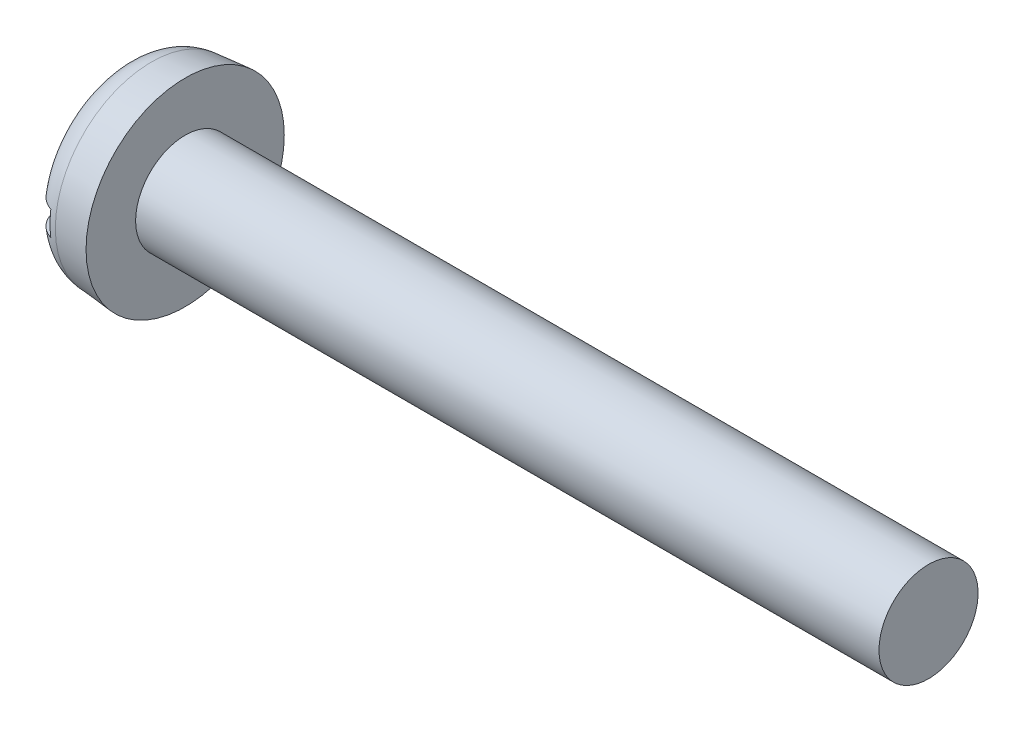
ISO-10303-21;
HEADER;
FILE_DESCRIPTION(('STEP AP214'),'2;1');
FILE_NAME('part.step','',(''),(''),'','','');
FILE_SCHEMA(('AUTOMOTIVE_DESIGN { 1 0 10303 214 1 1 1 1 }'));
ENDSEC;
DATA;
#1=APPLICATION_CONTEXT('core data for automotive mechanical design processes');
#2=APPLICATION_PROTOCOL_DEFINITION('international standard','automotive_design',2000,#1);
#3=PRODUCT_CONTEXT('',#1,'mechanical');
#4=PRODUCT('Part','Part','',(#3));
#5=PRODUCT_RELATED_PRODUCT_CATEGORY('part','',(#4));
#6=PRODUCT_DEFINITION_FORMATION('','',#4);
#7=PRODUCT_DEFINITION_CONTEXT('part definition',#1,'design');
#8=PRODUCT_DEFINITION('design','',#6,#7);
#9=PRODUCT_DEFINITION_SHAPE('','',#8);
#10=(LENGTH_UNIT() NAMED_UNIT(*) SI_UNIT(.MILLI.,.METRE.));
#11=(NAMED_UNIT(*) PLANE_ANGLE_UNIT() SI_UNIT($,.RADIAN.));
#12=(NAMED_UNIT(*) SI_UNIT($,.STERADIAN.) SOLID_ANGLE_UNIT());
#13=UNCERTAINTY_MEASURE_WITH_UNIT(LENGTH_MEASURE(1.E-05),#10,'distance_accuracy_value','');
#14=(GEOMETRIC_REPRESENTATION_CONTEXT(3) GLOBAL_UNCERTAINTY_ASSIGNED_CONTEXT((#13)) GLOBAL_UNIT_ASSIGNED_CONTEXT((#10,
#11,#12)) REPRESENTATION_CONTEXT('',''));
#15=CARTESIAN_POINT('',(0.,0.,0.));
#16=DIRECTION('',(0.,0.,1.));
#17=DIRECTION('',(1.,0.,0.));
#18=AXIS2_PLACEMENT_3D('',#15,#16,#17);
#19=CARTESIAN_POINT('',(0.,0.,0.));
#20=DIRECTION('',(-1.,0.,0.));
#21=DIRECTION('',(0.,0.,1.));
#22=AXIS2_PLACEMENT_3D('',#19,#20,#21);
#23=PLANE('',#22);
#24=DIRECTION('',(0.,0.,-1.));
#25=VECTOR('',#24,1.);
#26=CARTESIAN_POINT('',(0.,0.2,1.6));
#27=LINE('',#26,#25);
#28=CARTESIAN_POINT('',(0.,0.2,1.03520285906468));
#29=VERTEX_POINT('',#28);
#30=CARTESIAN_POINT('',(0.,0.2,-1.03520285906468));
#31=VERTEX_POINT('',#30);
#32=EDGE_CURVE('E97',#29,#31,#27,.T.);
#33=ORIENTED_EDGE('',*,*,#32,.F.);
#34=CARTESIAN_POINT('',(0.,0.,0.));
#35=DIRECTION('',(-1.,0.,0.));
#36=DIRECTION('',(0.,0.,1.));
#37=AXIS2_PLACEMENT_3D('',#34,#35,#36);
#38=CIRCLE('',#37,1.05434574946536);
#39=EDGE_CURVE('E102',#29,#31,#38,.T.);
#40=ORIENTED_EDGE('',*,*,#39,.T.);
#41=EDGE_LOOP('',(#33,#40));
#42=FACE_BOUND('',#41,.T.);
#43=ADVANCED_FACE('F39',(#42),#23,.T.);
#44=CARTESIAN_POINT('',(-25.4,0.,0.));
#45=DIRECTION('',(-1.,0.,0.));
#46=DIRECTION('',(0.,0.,1.));
#47=AXIS2_PLACEMENT_3D('',#44,#45,#46);
#48=CYLINDRICAL_SURFACE('',#47,0.8);
#49=CARTESIAN_POINT('',(13.,0.,0.));
#50=DIRECTION('',(-1.,0.,0.));
#51=DIRECTION('',(0.,0.,1.));
#52=AXIS2_PLACEMENT_3D('',#49,#50,#51);
#53=CIRCLE('',#52,0.8);
#54=CARTESIAN_POINT('',(13.,0.,0.8));
#55=VERTEX_POINT('',#54);
#56=EDGE_CURVE('E103',#55,#55,#53,.T.);
#57=ORIENTED_EDGE('',*,*,#56,.T.);
#58=EDGE_LOOP('',(#57));
#59=FACE_BOUND('',#58,.T.);
#60=CARTESIAN_POINT('',(1.,0.,0.));
#61=DIRECTION('',(-1.,0.,0.));
#62=DIRECTION('',(0.,0.,1.));
#63=AXIS2_PLACEMENT_3D('',#60,#61,#62);
#64=CIRCLE('',#63,0.8);
#65=CARTESIAN_POINT('',(1.,0.,0.8));
#66=VERTEX_POINT('',#65);
#67=EDGE_CURVE('E138',#66,#66,#64,.T.);
#68=ORIENTED_EDGE('',*,*,#67,.F.);
#69=EDGE_LOOP('',(#68));
#70=FACE_BOUND('',#69,.T.);
#71=ADVANCED_FACE('F155',(#59,#70),#48,.T.);
#72=CARTESIAN_POINT('',(13.,0.8,0.));
#73=DIRECTION('',(1.,0.,0.));
#74=DIRECTION('',(0.,0.,-1.));
#75=AXIS2_PLACEMENT_3D('',#72,#73,#74);
#76=PLANE('',#75);
#77=ORIENTED_EDGE('',*,*,#56,.F.);
#78=EDGE_LOOP('',(#77));
#79=FACE_BOUND('',#78,.T.);
#80=ADVANCED_FACE('F157',(#79),#76,.T.);
#81=DIRECTION('',(0.,0.,1.));
#82=VECTOR('',#81,1.);
#83=CARTESIAN_POINT('',(0.,-0.2,-1.6));
#84=LINE('',#83,#82);
#85=CARTESIAN_POINT('',(0.,-0.2,-1.03520285906468));
#86=VERTEX_POINT('',#85);
#87=CARTESIAN_POINT('',(0.,-0.2,1.03520285906468));
#88=VERTEX_POINT('',#87);
#89=EDGE_CURVE('E85',#86,#88,#84,.T.);
#90=ORIENTED_EDGE('',*,*,#89,.F.);
#91=EDGE_CURVE('E96',#86,#88,#38,.T.);
#92=ORIENTED_EDGE('',*,*,#91,.T.);
#93=EDGE_LOOP('',(#90,#92));
#94=FACE_BOUND('',#93,.T.);
#95=ADVANCED_FACE('F95',(#94),#23,.T.);
#96=CARTESIAN_POINT('',(0.,0.,0.));
#97=DIRECTION('',(1.,0.,0.));
#98=DIRECTION('',(0.,0.,-1.));
#99=AXIS2_PLACEMENT_3D('',#96,#97,#98);
#100=CONICAL_SURFACE('',#99,1.51251133647408,0.0872664625997166);
#101=CARTESIAN_POINT('',(0.45642212862617,0.,0.));
#102=DIRECTION('',(-1.,0.,0.));
#103=DIRECTION('',(0.,0.,1.));
#104=AXIS2_PLACEMENT_3D('',#101,#102,#103);
#105=CIRCLE('',#104,1.55244309851124);
#106=CARTESIAN_POINT('',(0.45642212862617,0.,1.55244309851124));
#107=VERTEX_POINT('',#106);
#108=EDGE_CURVE('E106',#107,#107,#105,.F.);
#109=ORIENTED_EDGE('',*,*,#108,.T.);
#110=EDGE_LOOP('',(#109));
#111=FACE_BOUND('',#110,.T.);
#112=CARTESIAN_POINT('',(1.,0.,0.));
#113=DIRECTION('',(-1.,0.,0.));
#114=DIRECTION('',(0.,0.,1.));
#115=AXIS2_PLACEMENT_3D('',#112,#113,#114);
#116=CIRCLE('',#115,1.6);
#117=CARTESIAN_POINT('',(1.,0.,1.6));
#118=VERTEX_POINT('',#117);
#119=EDGE_CURVE('E108',#118,#118,#116,.T.);
#120=ORIENTED_EDGE('',*,*,#119,.T.);
#121=EDGE_LOOP('',(#120));
#122=FACE_BOUND('',#121,.T.);
#123=ADVANCED_FACE('F148',(#111,#122),#100,.T.);
#124=CARTESIAN_POINT('',(1.,0.8,0.));
#125=DIRECTION('',(-1.,0.,0.));
#126=DIRECTION('',(0.,0.,1.));
#127=AXIS2_PLACEMENT_3D('',#124,#125,#126);
#128=PLANE('',#127);
#129=ORIENTED_EDGE('',*,*,#119,.F.);
#130=EDGE_LOOP('',(#129));
#131=FACE_BOUND('',#130,.T.);
#132=ORIENTED_EDGE('',*,*,#67,.T.);
#133=EDGE_LOOP('',(#132));
#134=FACE_BOUND('',#133,.T.);
#135=ADVANCED_FACE('F150',(#131,#134),#128,.F.);
#136=CARTESIAN_POINT('',(0.5,0.,0.));
#137=DIRECTION('',(-1.,0.,0.));
#138=DIRECTION('',(0.,0.,1.));
#139=AXIS2_PLACEMENT_3D('',#136,#137,#138);
#140=TOROIDAL_SURFACE('',#139,1.05434574946536,0.5);
#141=CARTESIAN_POINT('',(0.176812245338106,0.2,0.64242377529045));
#142=CARTESIAN_POINT('',(0.197656391566617,0.2,0.623931058161203));
#143=CARTESIAN_POINT('',(0.220003811754386,0.2,0.607110597550147));
#144=CARTESIAN_POINT('',(0.267180100797293,0.2,0.577365047702583));
#145=CARTESIAN_POINT('',(0.29201073445633,0.2,0.564442755444137));
#146=CARTESIAN_POINT('',(0.343577899023083,0.2,0.542985147318866));
#147=CARTESIAN_POINT('',(0.370318610468388,0.2,0.534459812106717));
#148=CARTESIAN_POINT('',(0.424877232699482,0.2,0.522255893957639));
#149=CARTESIAN_POINT('',(0.452694536220811,0.2,0.518574618533701));
#150=CARTESIAN_POINT('',(0.507347436456692,0.2,0.516300652750349));
#151=CARTESIAN_POINT('',(0.534174457413181,0.2,0.517498162918848));
#152=CARTESIAN_POINT('',(0.58723030288645,0.2,0.524448740072291));
#153=CARTESIAN_POINT('',(0.613459093306603,0.2,0.530202066055384));
#154=CARTESIAN_POINT('',(0.664260657505057,0.2,0.545888682290312));
#155=CARTESIAN_POINT('',(0.688850242352039,0.2,0.555767914890473));
#156=CARTESIAN_POINT('',(0.736143593168965,0.2,0.579309540129041));
#157=CARTESIAN_POINT('',(0.758846941478746,0.2,0.592972767752087));
#158=CARTESIAN_POINT('',(0.803002149253038,0.2,0.624449004423589));
#159=CARTESIAN_POINT('',(0.824325241599832,0.2,0.642442581537573));
#160=CARTESIAN_POINT('',(0.863838792989557,0.2,0.681591476361993));
#161=CARTESIAN_POINT('',(0.882028505825668,0.2,0.702747544977853));
#162=CARTESIAN_POINT('',(0.915707701545327,0.2,0.74883168283776));
#163=CARTESIAN_POINT('',(0.931007353951227,0.2,0.773898769970746));
#164=CARTESIAN_POINT('',(0.957255163391441,0.2,0.826217807423045));
#165=CARTESIAN_POINT('',(0.968202858285345,0.2,0.853469989411554));
#166=CARTESIAN_POINT('',(0.985551351159771,0.2,0.909833347099569));
#167=CARTESIAN_POINT('',(0.991882119167743,0.2,0.938966139449398));
#168=CARTESIAN_POINT('',(0.999504543382141,0.2,0.997884971759474));
#169=CARTESIAN_POINT('',(1.00079638965494,0.2,1.02767098703776));
#170=CARTESIAN_POINT('',(0.998270807715911,0.2,1.0867005797359));
#171=CARTESIAN_POINT('',(0.994509106386988,0.2,1.11594652682857));
#172=CARTESIAN_POINT('',(0.98203838488836,0.2,1.1733647846461));
#173=CARTESIAN_POINT('',(0.973329806868564,0.2,1.2015371910835));
#174=CARTESIAN_POINT('',(0.951381229972232,0.2,1.25547754006911));
#175=CARTESIAN_POINT('',(0.938224017100543,0.2,1.28127917230232));
#176=CARTESIAN_POINT('',(0.907700193056589,0.2,1.33025976678729));
#177=CARTESIAN_POINT('',(0.890333940077136,0.2,1.3534389519654));
#178=CARTESIAN_POINT('',(0.85217525831849,0.2,1.39614558195128));
#179=CARTESIAN_POINT('',(0.831439066113531,0.2,1.4157232869619));
#180=CARTESIAN_POINT('',(0.786943706790343,0.2,1.45107407519974));
#181=CARTESIAN_POINT('',(0.763184726605645,0.2,1.46684739352114));
#182=CARTESIAN_POINT('',(0.713591926333196,0.2,1.49397124782911));
#183=CARTESIAN_POINT('',(0.687782778867004,0.2,1.5053669084919));
#184=CARTESIAN_POINT('',(0.63461007787033,0.2,1.52363335073435));
#185=CARTESIAN_POINT('',(0.607246584142757,0.2,1.53050430627248));
#186=CARTESIAN_POINT('',(0.551920857622793,0.2,1.53948979359232));
#187=CARTESIAN_POINT('',(0.523963277706674,0.2,1.54163299551716));
#188=CARTESIAN_POINT('',(0.468086326713314,0.2,1.54118492593322));
#189=CARTESIAN_POINT('',(0.440166954979164,0.2,1.53859373687223));
#190=CARTESIAN_POINT('',(0.385217043681331,0.2,1.52876323513846));
#191=CARTESIAN_POINT('',(0.35818483875328,0.2,1.5215332253464));
#192=CARTESIAN_POINT('',(0.305714751463575,0.2,1.50264566880826));
#193=CARTESIAN_POINT('',(0.280276869405813,0.2,1.49098812121825));
#194=CARTESIAN_POINT('',(0.231662744368,0.2,1.4635592872359));
#195=CARTESIAN_POINT('',(0.208490831702472,0.2,1.44778032802949));
#196=CARTESIAN_POINT('',(0.165105790935981,0.2,1.4125771312255));
#197=CARTESIAN_POINT('',(0.144892723015596,0.2,1.39315281950264));
#198=CARTESIAN_POINT('',(0.107866474694936,0.2,1.35109338309971));
#199=CARTESIAN_POINT('',(0.0910739608161848,0.2,1.32844006983289));
#200=CARTESIAN_POINT('',(0.0614863187518137,0.2,1.28065921570801));
#201=CARTESIAN_POINT('',(0.0486913644535786,0.2,1.25553156728288));
#202=CARTESIAN_POINT('',(0.0273148341415875,0.2,1.20324342811195));
#203=CARTESIAN_POINT('',(0.0187777691661442,0.2,1.17606474761039));
#204=CARTESIAN_POINT('',(0.00631625826477566,0.2,1.12067195571522));
#205=CARTESIAN_POINT('',(0.00239193428353282,0.2,1.09245781696807));
#206=CARTESIAN_POINT('',(-0.000800718171925735,0.2,1.0353548754087));
#207=CARTESIAN_POINT('',(-2.54167093825939E-07,0.2,1.00646223595315));
#208=CARTESIAN_POINT('',(0.00635345942686706,0.2,0.949197931620799));
#209=CARTESIAN_POINT('',(0.0119082056813895,0.2,0.920826433674443));
#210=CARTESIAN_POINT('',(0.0277231669345134,0.2,0.864879673195364));
#211=CARTESIAN_POINT('',(0.038065816072315,0.2,0.837327748177695));
#212=CARTESIAN_POINT('',(0.0631658487432299,0.2,0.784336207465033));
#213=CARTESIAN_POINT('',(0.0779192415941294,0.2,0.758894708801055));
#214=CARTESIAN_POINT('',(0.106480616423255,0.2,0.717908727904648));
#215=CARTESIAN_POINT('',(0.119286907445074,0.2,0.701656482649832));
#216=CARTESIAN_POINT('',(0.14672396732377,0.2,0.67077086176156));
#217=CARTESIAN_POINT('',(0.161354756464739,0.2,0.656137504129709));
#218=CARTESIAN_POINT('',(0.176812245338106,0.2,0.64242377529045));
#219=B_SPLINE_CURVE_WITH_KNOTS('',3,(#141,#142,#143,#144,#145,#146,#147,#148,#149,#150,#151,
#152,#153,#154,#155,#156,#157,#158,#159,#160,#161,#162,#163,#164,#165,#166,#167,#168,#169,#170,
#171,#172,#173,#174,#175,#176,#177,#178,#179,#180,#181,#182,#183,#184,#185,#186,#187,#188,#189,
#190,#191,#192,#193,#194,#195,#196,#197,#198,#199,#200,#201,#202,#203,#204,#205,#206,#207,#208,
#209,#210,#211,#212,#213,#214,#215,#216,#217,#218),.UNSPECIFIED.,.T.,.F.,(4,2,2,2,2,2,2,2,2,2,2,
2,2,2,2,2,2,2,2,2,2,2,2,2,2,2,2,2,2,2,2,2,2,2,2,2,2,2,4),(0.,0.0835254361813604,
0.16711066099808,0.250884790042371,0.334612334986441,0.414778234839672,0.494948692451877,
0.574100167055879,0.65326912133305,0.736605061008668,0.819960819583614,0.907655316034342,
0.995359122399358,1.08436702847711,1.17337157717508,1.26140266077387,1.3494258774265,
1.43589378334721,1.52235433335935,1.60749748228452,1.69263536839262,1.77687047067773,
1.86110233424006,1.94482197647998,2.02854016078533,2.11209097577706,2.19564180669433,
2.2793493064507,2.36305850851542,2.44725937592745,2.53146390543144,2.61653114832757,
2.70160064005245,2.78791176181946,2.87425006464032,2.96213355572929,3.04993777240123,
3.11187742352654,3.17381776333526),.UNSPECIFIED.);
#220=CARTESIAN_POINT('',(0.35,0.2,1.51819850536022));
#221=VERTEX_POINT('',#220);
#222=EDGE_CURVE('E11',#221,#29,#219,.T.);
#223=ORIENTED_EDGE('',*,*,#222,.F.);
#224=CARTESIAN_POINT('',(0.35,0.,0.));
#225=DIRECTION('',(1.,0.,0.));
#226=DIRECTION('',(0.,0.,-1.));
#227=AXIS2_PLACEMENT_3D('',#224,#225,#226);
#228=CIRCLE('',#227,1.53131535017384);
#229=CARTESIAN_POINT('',(0.35,-0.2,1.51819850536022));
#230=VERTEX_POINT('',#229);
#231=EDGE_CURVE('E114',#230,#221,#228,.F.);
#232=ORIENTED_EDGE('',*,*,#231,.F.);
#233=CARTESIAN_POINT('',(0.176812245338106,-0.2,0.64242377529045));
#234=CARTESIAN_POINT('',(0.154702612307565,-0.2,0.662041585192781));
#235=CARTESIAN_POINT('',(0.134253297161549,-0.2,0.683570248770683));
#236=CARTESIAN_POINT('',(0.0972327579800641,-0.2,0.729775132087799));
#237=CARTESIAN_POINT('',(0.0806680483139015,-0.2,0.754456533338215));
#238=CARTESIAN_POINT('',(0.0519072561458669,-0.2,0.806221960091405));
#239=CARTESIAN_POINT('',(0.0397074393427576,-0.2,0.833303906979414));
#240=CARTESIAN_POINT('',(0.0200236232864323,-0.2,0.889118714678709));
#241=CARTESIAN_POINT('',(0.0125376920736543,-0.2,0.917850893876096));
#242=CARTESIAN_POINT('',(0.00251353684755929,-0.2,0.97621768314863));
#243=CARTESIAN_POINT('',(-1.64442575973229E-05,-0.2,1.00585371355918));
#244=CARTESIAN_POINT('',(1.66033602025546E-05,-0.2,1.06512652692138));
#245=CARTESIAN_POINT('',(0.00257970072502551,-0.2,1.09476330987778));
#246=CARTESIAN_POINT('',(0.0126917533382931,-0.2,1.1527074778913));
#247=CARTESIAN_POINT('',(0.0201638959754937,-0.2,1.18102825913155));
#248=CARTESIAN_POINT('',(0.0398408409860872,-0.2,1.2359754802176));
#249=CARTESIAN_POINT('',(0.0520451647411386,-0.2,1.26260209109683));
#250=CARTESIAN_POINT('',(0.0806073130285893,-0.2,1.31291602673095));
#251=CARTESIAN_POINT('',(0.0968895702503699,-0.2,1.33664625812301));
#252=CARTESIAN_POINT('',(0.133257839056495,-0.2,1.38098733360306));
#253=CARTESIAN_POINT('',(0.153343553406197,-0.2,1.40159842122129));
#254=CARTESIAN_POINT('',(0.196451203328787,-0.2,1.43882523867761));
#255=CARTESIAN_POINT('',(0.219429674182239,-0.2,1.45549131261205));
#256=CARTESIAN_POINT('',(0.267878667804026,-0.2,1.48468852159065));
#257=CARTESIAN_POINT('',(0.293349062314391,-0.2,1.49721986930193));
#258=CARTESIAN_POINT('',(0.345815128829973,-0.2,1.517681912311));
#259=CARTESIAN_POINT('',(0.372795327070427,-0.2,1.52565229791238));
#260=CARTESIAN_POINT('',(0.427713479707297,-0.2,1.53692751254217));
#261=CARTESIAN_POINT('',(0.455651404638834,-0.2,1.54023248497234));
#262=CARTESIAN_POINT('',(0.511557840216115,-0.2,1.54207504417347));
#263=CARTESIAN_POINT('',(0.539525649691558,-0.2,1.54063398012742));
#264=CARTESIAN_POINT('',(0.594821363561878,-0.2,1.53307394104472));
#265=CARTESIAN_POINT('',(0.622149274572845,-0.2,1.52695501439583));
#266=CARTESIAN_POINT('',(0.675376478271589,-0.2,1.51022327849377));
#267=CARTESIAN_POINT('',(0.701276516642561,-0.2,1.49961284047348));
#268=CARTESIAN_POINT('',(0.750935613149242,-0.2,1.47420824530533));
#269=CARTESIAN_POINT('',(0.774694654695417,-0.2,1.4594140557433));
#270=CARTESIAN_POINT('',(0.819487137689512,-0.2,1.42601464842765));
#271=CARTESIAN_POINT('',(0.840511160782153,-0.2,1.40739680279129));
#272=CARTESIAN_POINT('',(0.879162866353838,-0.2,1.36691918237975));
#273=CARTESIAN_POINT('',(0.8967904573245,-0.2,1.3450593202846));
#274=CARTESIAN_POINT('',(0.928296276700787,-0.2,1.29854787388723));
#275=CARTESIAN_POINT('',(0.942145481911513,-0.2,1.27387663567349));
#276=CARTESIAN_POINT('',(0.96556015148179,-0.2,1.22258005393831));
#277=CARTESIAN_POINT('',(0.975125409575014,-0.2,1.19595461639661));
#278=CARTESIAN_POINT('',(0.989830044230755,-0.2,1.14116777091253));
#279=CARTESIAN_POINT('',(0.994915183325904,-0.2,1.11299181373592));
#280=CARTESIAN_POINT('',(1.00036331847097,-0.2,1.05618799558154));
#281=CARTESIAN_POINT('',(1.00072594918917,-0.2,1.02756009981345));
#282=CARTESIAN_POINT('',(0.996728541355129,-0.2,0.970172137882063));
#283=CARTESIAN_POINT('',(0.992292215789273,-0.2,0.941417390803934));
#284=CARTESIAN_POINT('',(0.978738893833073,-0.2,0.885033177627237));
#285=CARTESIAN_POINT('',(0.969621429784218,-0.2,0.857403824256291));
#286=CARTESIAN_POINT('',(0.946786518376835,-0.2,0.803555744981816));
#287=CARTESIAN_POINT('',(0.932993027302192,-0.2,0.777369247398886));
#288=CARTESIAN_POINT('',(0.901235552715302,-0.2,0.727655106507426));
#289=CARTESIAN_POINT('',(0.883270945770642,-0.2,0.704127861444231));
#290=CARTESIAN_POINT('',(0.843510715272406,-0.2,0.660269585851966));
#291=CARTESIAN_POINT('',(0.821689860961845,-0.2,0.639961387802399));
#292=CARTESIAN_POINT('',(0.774870470566996,-0.2,0.603404198864377));
#293=CARTESIAN_POINT('',(0.749872173965661,-0.2,0.58715490233103));
#294=CARTESIAN_POINT('',(0.698057628210497,-0.2,0.559713743668722));
#295=CARTESIAN_POINT('',(0.671305060156738,-0.2,0.548402028597034));
#296=CARTESIAN_POINT('',(0.616208466179293,-0.2,0.530766704780977));
#297=CARTESIAN_POINT('',(0.587865482480594,-0.2,0.524439869329184));
#298=CARTESIAN_POINT('',(0.532256981834864,-0.2,0.517338275648884));
#299=CARTESIAN_POINT('',(0.505031591859405,-0.2,0.516247604966095));
#300=CARTESIAN_POINT('',(0.450800919779456,-0.2,0.518818406203716));
#301=CARTESIAN_POINT('',(0.423795667458096,-0.2,0.522480510746835));
#302=CARTESIAN_POINT('',(0.371631393142633,-0.2,0.534183158459801));
#303=CARTESIAN_POINT('',(0.346441169120205,-0.2,0.542086434018936));
#304=CARTESIAN_POINT('',(0.297683954206147,-0.2,0.561836906568103));
#305=CARTESIAN_POINT('',(0.274115374435305,-0.2,0.573680174801029));
#306=CARTESIAN_POINT('',(0.238350445927474,-0.2,0.595303011811934));
#307=CARTESIAN_POINT('',(0.225448951820625,-0.2,0.603942086476775));
#308=CARTESIAN_POINT('',(0.200483216576451,-0.2,0.622353186457711));
#309=CARTESIAN_POINT('',(0.188418951937856,-0.2,0.632125179951871));
#310=CARTESIAN_POINT('',(0.176812245338106,-0.2,0.64242377529045));
#311=B_SPLINE_CURVE_WITH_KNOTS('',3,(#233,#234,#235,#236,#237,#238,#239,#240,#241,#242,#243,
#244,#245,#246,#247,#248,#249,#250,#251,#252,#253,#254,#255,#256,#257,#258,#259,#260,#261,#262,
#263,#264,#265,#266,#267,#268,#269,#270,#271,#272,#273,#274,#275,#276,#277,#278,#279,#280,#281,
#282,#283,#284,#285,#286,#287,#288,#289,#290,#291,#292,#293,#294,#295,#296,#297,#298,#299,#300,
#301,#302,#303,#304,#305,#306,#307,#308,#309,#310),.UNSPECIFIED.,.T.,.F.,(4,2,2,2,2,2,2,2,2,2,2,
2,2,2,2,2,2,2,2,2,2,2,2,2,2,2,2,2,2,2,2,2,2,2,2,2,2,2,4),(0.,0.0886172824475868,
0.17738212743566,0.266070848724325,0.354723197739846,0.443522871641907,0.532323742347971,
0.619767204878502,0.707201825580768,0.79312269780187,0.879036858200784,0.963787100566757,
1.04853298317591,1.13252971593854,1.21652386682017,1.30014070224384,1.38375667274753,
1.46732855427333,1.55090108330091,1.63475418745175,1.71860955049923,1.80309197806349,
1.88757847290652,1.97307425899342,2.05857665896751,2.14545850179557,2.23234902604625,
2.32072639222391,2.40911697616501,2.49810887551969,2.58709407155213,2.67377949802359,
2.76040876690365,2.84173954987536,2.92308115956936,3.00193621963368,3.08071288401749,
3.12723485387296,3.17375551731479),.UNSPECIFIED.);
#312=EDGE_CURVE('E52',#88,#230,#311,.T.);
#313=ORIENTED_EDGE('',*,*,#312,.F.);
#314=ORIENTED_EDGE('',*,*,#91,.F.);
#315=CARTESIAN_POINT('',(0.209021499817963,-0.2,-1.44720111123624));
#316=CARTESIAN_POINT('',(0.186122748418178,-0.2,-1.43065687892588));
#317=CARTESIAN_POINT('',(0.164613802448487,-0.2,-1.41215115048449));
#318=CARTESIAN_POINT('',(0.125002122817551,-0.2,-1.37176488184652));
#319=CARTESIAN_POINT('',(0.106903917106941,-0.2,-1.34987992464308));
#320=CARTESIAN_POINT('',(0.0746460841806091,-0.2,-1.30340745333833));
#321=CARTESIAN_POINT('',(0.0604827083892178,-0.2,-1.27882254276704));
#322=CARTESIAN_POINT('',(0.0364483637954418,-0.2,-1.2276478824117));
#323=CARTESIAN_POINT('',(0.0265763120603445,-0.2,-1.20105864041838));
#324=CARTESIAN_POINT('',(0.0112893070274943,-0.2,-1.14637257569651));
#325=CARTESIAN_POINT('',(0.00591501269441761,-0.2,-1.11826439507127));
#326=CARTESIAN_POINT('',(-0.00011839535928145,-0.2,-1.06154626587441));
#327=CARTESIAN_POINT('',(-0.000776960929562767,-0.2,-1.03293625935863));
#328=CARTESIAN_POINT('',(0.00262524324847147,-0.2,-0.975538416063035));
#329=CARTESIAN_POINT('',(0.00676182225957517,-0.2,-0.946755078615841));
#330=CARTESIAN_POINT('',(0.0197241520147937,-0.2,-0.890264626387197));
#331=CARTESIAN_POINT('',(0.0285503642820931,-0.2,-0.862557617819076));
#332=CARTESIAN_POINT('',(0.050814282720423,-0.2,-0.808503040390441));
#333=CARTESIAN_POINT('',(0.064328671010167,-0.2,-0.782187037620903));
#334=CARTESIAN_POINT('',(0.0955507531013224,-0.2,-0.732167625966484));
#335=CARTESIAN_POINT('',(0.113259054895109,-0.2,-0.708464596615632));
#336=CARTESIAN_POINT('',(0.152545834900341,-0.2,-0.664194658393628));
#337=CARTESIAN_POINT('',(0.174152071647115,-0.2,-0.64365234076647));
#338=CARTESIAN_POINT('',(0.220581625116487,-0.2,-0.606587015041178));
#339=CARTESIAN_POINT('',(0.245404747447988,-0.2,-0.590063764250888));
#340=CARTESIAN_POINT('',(0.296954326646332,-0.2,-0.562026605789653));
#341=CARTESIAN_POINT('',(0.323619163754996,-0.2,-0.550399768890506));
#342=CARTESIAN_POINT('',(0.378598982319635,-0.2,-0.532119902089164));
#343=CARTESIAN_POINT('',(0.406912966682745,-0.2,-0.525463899734445));
#344=CARTESIAN_POINT('',(0.462540441137298,-0.2,-0.517724781964009));
#345=CARTESIAN_POINT('',(0.489810500422485,-0.2,-0.516328232903131));
#346=CARTESIAN_POINT('',(0.544173553857568,-0.2,-0.518310829708948));
#347=CARTESIAN_POINT('',(0.571266574738007,-0.2,-0.521689237058414));
#348=CARTESIAN_POINT('',(0.623579103302409,-0.2,-0.532854204126788));
#349=CARTESIAN_POINT('',(0.648830944681241,-0.2,-0.540490929218404));
#350=CARTESIAN_POINT('',(0.697772455593545,-0.2,-0.55973224120313));
#351=CARTESIAN_POINT('',(0.721461801984531,-0.2,-0.571337645816021));
#352=CARTESIAN_POINT('',(0.767640471980269,-0.2,-0.598638564928931));
#353=CARTESIAN_POINT('',(0.790043937207254,-0.2,-0.614479068703996));
#354=CARTESIAN_POINT('',(0.832065998844156,-0.2,-0.649500289637885));
#355=CARTESIAN_POINT('',(0.851683909507113,-0.2,-0.66868182671231));
#356=CARTESIAN_POINT('',(0.888752356518102,-0.2,-0.711069507251301));
#357=CARTESIAN_POINT('',(0.906009129853732,-0.2,-0.734445379999887));
#358=CARTESIAN_POINT('',(0.936469675553122,-0.2,-0.783705044727337));
#359=CARTESIAN_POINT('',(0.949672830141508,-0.2,-0.809589218183591));
#360=CARTESIAN_POINT('',(0.97193850057002,-0.2,-0.863845707677464));
#361=CARTESIAN_POINT('',(0.980889021372485,-0.2,-0.892264106083921));
#362=CARTESIAN_POINT('',(0.993860437115331,-0.2,-0.950205978188054));
#363=CARTESIAN_POINT('',(0.997881369764178,-0.2,-0.979729443430835));
#364=CARTESIAN_POINT('',(1.00082434300442,-0.2,-1.03884993394592));
#365=CARTESIAN_POINT('',(0.999777497764573,-0.2,-1.06844539811389));
#366=CARTESIAN_POINT('',(0.992639369498306,-0.2,-1.12702257664223));
#367=CARTESIAN_POINT('',(0.986548509891841,-0.2,-1.15600434231011));
#368=CARTESIAN_POINT('',(0.969607791248461,-0.2,-1.21199828635368));
#369=CARTESIAN_POINT('',(0.958841535918028,-0.2,-1.23903575728609));
#370=CARTESIAN_POINT('',(0.932848885604661,-0.2,-1.29087503168137));
#371=CARTESIAN_POINT('',(0.91762288067342,-0.2,-1.31567703041167));
#372=CARTESIAN_POINT('',(0.883415752591074,-0.2,-1.36191456450718));
#373=CARTESIAN_POINT('',(0.864499859675284,-0.2,-1.38339836938881));
#374=CARTESIAN_POINT('',(0.823290799290222,-0.2,-1.42283763433664));
#375=CARTESIAN_POINT('',(0.800997856521276,-0.2,-1.44079332897189));
#376=CARTESIAN_POINT('',(0.753955665849216,-0.2,-1.47244698052649));
#377=CARTESIAN_POINT('',(0.729238701078551,-0.2,-1.48619292864572));
#378=CARTESIAN_POINT('',(0.677836459862761,-0.2,-1.50930448914476));
#379=CARTESIAN_POINT('',(0.651151351485749,-0.2,-1.51867047504783));
#380=CARTESIAN_POINT('',(0.596781408850947,-0.2,-1.532692169484));
#381=CARTESIAN_POINT('',(0.569105381332732,-0.2,-1.53738204892999));
#382=CARTESIAN_POINT('',(0.513351073329721,-0.2,-1.54203383413956));
#383=CARTESIAN_POINT('',(0.485272699578506,-0.2,-1.54199462534522));
#384=CARTESIAN_POINT('',(0.429598553005631,-0.2,-1.53719466257796));
#385=CARTESIAN_POINT('',(0.402001724716619,-0.2,-1.53244605213924));
#386=CARTESIAN_POINT('',(0.348021402247289,-0.2,-1.5183866411881));
#387=CARTESIAN_POINT('',(0.321636430625271,-0.2,-1.5090815663995));
#388=CARTESIAN_POINT('',(0.280891455620182,-0.2,-1.49073905063249));
#389=CARTESIAN_POINT('',(0.265907224964648,-0.2,-1.48305487086197));
#390=CARTESIAN_POINT('',(0.236791491627114,-0.2,-1.46621276821471));
#391=CARTESIAN_POINT('',(0.222659986719118,-0.2,-1.45705484918532));
#392=CARTESIAN_POINT('',(0.209021499817963,-0.2,-1.44720111123624));
#393=B_SPLINE_CURVE_WITH_KNOTS('',3,(#315,#316,#317,#318,#319,#320,#321,#322,#323,#324,#325,
#326,#327,#328,#329,#330,#331,#332,#333,#334,#335,#336,#337,#338,#339,#340,#341,#342,#343,#344,
#345,#346,#347,#348,#349,#350,#351,#352,#353,#354,#355,#356,#357,#358,#359,#360,#361,#362,#363,
#364,#365,#366,#367,#368,#369,#370,#371,#372,#373,#374,#375,#376,#377,#378,#379,#380,#381,#382,
#383,#384,#385,#386,#387,#388,#389,#390,#391,#392),.UNSPECIFIED.,.T.,.F.,(4,2,2,2,2,2,2,2,2,2,2,
2,2,2,2,2,2,2,2,2,2,2,2,2,2,2,2,2,2,2,2,2,2,2,2,2,2,2,4),(0.,0.0846878562604973,
0.16948736044048,0.2542057998735,0.338902847842209,0.424357516871669,0.509822118882446,
0.596656521805781,0.683499471989195,0.771835628438137,0.860184598842492,0.949189529618496,
1.03818908447891,1.12500564078518,1.21177024099185,1.29327399482486,1.3747651442831,
1.45355500695188,1.5323611135343,1.61431830608254,1.69629563997531,1.78306560209964,
1.86984878149251,1.95880564503608,2.0477618281074,2.13617255026534,2.22457585153441,
2.31145955910979,2.39833567006515,2.48379618244436,2.56925101099358,2.65369189764631,
2.73812558186452,2.82193763799998,2.90576944711298,2.98938565038903,3.07289704884794,
3.12333723282884,3.17377728513259),.UNSPECIFIED.);
#394=CARTESIAN_POINT('',(0.35,-0.2,-1.51819850536022));
#395=VERTEX_POINT('',#394);
#396=EDGE_CURVE('E82',#395,#86,#393,.T.);
#397=ORIENTED_EDGE('',*,*,#396,.F.);
#398=CARTESIAN_POINT('',(0.35,0.2,-1.51819850536022));
#399=VERTEX_POINT('',#398);
#400=EDGE_CURVE('E91',#399,#395,#228,.F.);
#401=ORIENTED_EDGE('',*,*,#400,.F.);
#402=CARTESIAN_POINT('',(0.209021499817963,0.2,-1.44720111123624));
#403=CARTESIAN_POINT('',(0.231659941137034,0.2,-1.46355413178781));
#404=CARTESIAN_POINT('',(0.255689818432294,0.2,-1.47801452215843));
#405=CARTESIAN_POINT('',(0.305854576840009,0.2,-1.50271047561211));
#406=CARTESIAN_POINT('',(0.331991818036317,0.2,-1.51294122102487));
#407=CARTESIAN_POINT('',(0.385609226558411,0.2,-1.52885984689101));
#408=CARTESIAN_POINT('',(0.413088983400637,0.2,-1.53454910682393));
#409=CARTESIAN_POINT('',(0.468607080189714,0.2,-1.54121911450824));
#410=CARTESIAN_POINT('',(0.496645285397363,0.2,-1.5422009845377));
#411=CARTESIAN_POINT('',(0.552422799879022,0.2,-1.53943414375897));
#412=CARTESIAN_POINT('',(0.58016264630378,0.2,-1.53569625291144));
#413=CARTESIAN_POINT('',(0.63462205163315,0.2,-1.52361782833393));
#414=CARTESIAN_POINT('',(0.661341580362917,0.2,-1.51527715859404));
#415=CARTESIAN_POINT('',(0.713015340417279,0.2,-1.49423300399112));
#416=CARTESIAN_POINT('',(0.737968862468665,0.2,-1.48152777806942));
#417=CARTESIAN_POINT('',(0.785400549169818,0.2,-1.4521254422675));
#418=CARTESIAN_POINT('',(0.80787868713526,0.2,-1.43542828936097));
#419=CARTESIAN_POINT('',(0.849830735809496,0.2,-1.39844426212838));
#420=CARTESIAN_POINT('',(0.869291207245726,0.2,-1.37814214710056));
#421=CARTESIAN_POINT('',(0.904561335625627,0.2,-1.33458309765222));
#422=CARTESIAN_POINT('',(0.920370882948668,0.2,-1.31132607454176));
#423=CARTESIAN_POINT('',(0.948041611981333,0.2,-1.26230898150753));
#424=CARTESIAN_POINT('',(0.959867913540936,0.2,-1.23652922769644));
#425=CARTESIAN_POINT('',(0.979086311587476,0.2,-1.18336789465759));
#426=CARTESIAN_POINT('',(0.986478161888597,0.2,-1.15598622658955));
#427=CARTESIAN_POINT('',(0.99672785731409,0.2,-1.10001821282817));
#428=CARTESIAN_POINT('',(0.999525279964552,0.2,-1.07142080979166));
#429=CARTESIAN_POINT('',(1.00036372618921,0.2,-1.01415726923613));
#430=CARTESIAN_POINT('',(0.998404352361653,0.2,-0.98549112617417));
#431=CARTESIAN_POINT('',(0.989750739478325,0.2,-0.928387976774154));
#432=CARTESIAN_POINT('',(0.982977192562942,0.2,-0.899962991274051));
#433=CARTESIAN_POINT('',(0.964831586002546,0.2,-0.844620277351307));
#434=CARTESIAN_POINT('',(0.953459026982048,0.2,-0.817702712970759));
#435=CARTESIAN_POINT('',(0.926225110228056,0.2,-0.765686979411009));
#436=CARTESIAN_POINT('',(0.910294465011483,0.2,-0.740625057453274));
#437=CARTESIAN_POINT('',(0.874457300896757,0.2,-0.69351843805825));
#438=CARTESIAN_POINT('',(0.854550196620211,0.2,-0.671474185661202));
#439=CARTESIAN_POINT('',(0.811255618971962,0.2,-0.631056919127044));
#440=CARTESIAN_POINT('',(0.787864253123593,0.2,-0.612688065476461));
#441=CARTESIAN_POINT('',(0.738233909696237,0.2,-0.580307105618133));
#442=CARTESIAN_POINT('',(0.711995600088768,0.2,-0.566293980405583));
#443=CARTESIAN_POINT('',(0.658411786813969,0.2,-0.54365138540197));
#444=CARTESIAN_POINT('',(0.631141694080634,0.2,-0.534844020067327));
#445=CARTESIAN_POINT('',(0.575466809457536,0.2,-0.522277216417838));
#446=CARTESIAN_POINT('',(0.547062680323904,0.2,-0.518514872892667));
#447=CARTESIAN_POINT('',(0.491811130755031,0.2,-0.516313666633036));
#448=CARTESIAN_POINT('',(0.464975808680366,0.2,-0.517560628331808));
#449=CARTESIAN_POINT('',(0.411912730039869,0.2,-0.524611466360403));
#450=CARTESIAN_POINT('',(0.385684979086227,0.2,-0.530415384765983));
#451=CARTESIAN_POINT('',(0.334899460639686,0.2,-0.546200096419524));
#452=CARTESIAN_POINT('',(0.310324494902056,0.2,-0.556125954908871));
#453=CARTESIAN_POINT('',(0.263066985791903,0.2,-0.579757130410148));
#454=CARTESIAN_POINT('',(0.240384867383554,0.2,-0.593463293182602));
#455=CARTESIAN_POINT('',(0.196274896338125,0.2,-0.62502652149485));
#456=CARTESIAN_POINT('',(0.174976657079979,0.2,-0.643064658161806));
#457=CARTESIAN_POINT('',(0.135520080739938,0.2,-0.682298711868878));
#458=CARTESIAN_POINT('',(0.117362499668052,0.2,-0.703495386943607));
#459=CARTESIAN_POINT('',(0.0837592681235482,0.2,-0.749654011599363));
#460=CARTESIAN_POINT('',(0.0685031891950621,0.2,-0.774754253687457));
#461=CARTESIAN_POINT('',(0.042348375409236,0.2,-0.827132358691848));
#462=CARTESIAN_POINT('',(0.0314501021941615,0.2,-0.85441045195086));
#463=CARTESIAN_POINT('',(0.014207692602473,0.2,-0.910812498375578));
#464=CARTESIAN_POINT('',(0.0079327855230263,0.2,-0.939957675835882));
#465=CARTESIAN_POINT('',(0.000424133912273718,0.2,-0.998890534246519));
#466=CARTESIAN_POINT('',(-0.000809998106316204,0.2,-1.02867816563408));
#467=CARTESIAN_POINT('',(0.00182976001452007,0.2,-1.08769522731211));
#468=CARTESIAN_POINT('',(0.00564696083815952,0.2,-1.11692718058951));
#469=CARTESIAN_POINT('',(0.0182271077139673,0.2,-1.17431618737652));
#470=CARTESIAN_POINT('',(0.0269908664196951,0.2,-1.20247306345355));
#471=CARTESIAN_POINT('',(0.0490488696622141,0.2,-1.25638422396361));
#472=CARTESIAN_POINT('',(0.062262644084458,0.2,-1.28217148911756));
#473=CARTESIAN_POINT('',(0.0928885063417047,0.2,-1.3310892234745));
#474=CARTESIAN_POINT('',(0.110295035205786,0.2,-1.35422315115332));
#475=CARTESIAN_POINT('',(0.141464530020152,0.2,-1.38897530161554));
#476=CARTESIAN_POINT('',(0.154095408523145,0.2,-1.40162696556314));
#477=CARTESIAN_POINT('',(0.180635004655155,0.2,-1.42551080352041));
#478=CARTESIAN_POINT('',(0.194543711375822,0.2,-1.43674298964568));
#479=CARTESIAN_POINT('',(0.209021499817963,0.2,-1.44720111123624));
#480=B_SPLINE_CURVE_WITH_KNOTS('',3,(#402,#403,#404,#405,#406,#407,#408,#409,#410,#411,#412,
#413,#414,#415,#416,#417,#418,#419,#420,#421,#422,#423,#424,#425,#426,#427,#428,#429,#430,#431,
#432,#433,#434,#435,#436,#437,#438,#439,#440,#441,#442,#443,#444,#445,#446,#447,#448,#449,#450,
#451,#452,#453,#454,#455,#456,#457,#458,#459,#460,#461,#462,#463,#464,#465,#466,#467,#468,#469,
#470,#471,#472,#473,#474,#475,#476,#477,#478,#479),.UNSPECIFIED.,.T.,.F.,(4,2,2,2,2,2,2,2,2,2,2,
2,2,2,2,2,2,2,2,2,2,2,2,2,2,2,2,2,2,2,2,2,2,2,2,2,2,2,4),(0.,0.0837163073778265,
0.16752770872243,0.251313642594852,0.33507960026062,0.41865387426646,0.502230617984072,
0.585840739966371,0.669451763166922,0.753425071135857,0.837400900113229,0.922094043758889,
1.00679188884794,1.09259494864017,1.17840517700883,1.26566280916234,1.35292991857455,
1.44160130250583,1.53028574947026,1.61907002468243,1.70783351351733,1.79335589110469,
1.87882899886573,1.95902771878604,2.03922717921404,2.11839044948203,2.19757144518957,
2.28093653847568,2.36432167131851,2.45203291249448,2.53975344286284,2.62876217789799,
2.71776407065159,2.80577554910371,2.8938014908795,2.98031424109074,3.06671291354612,
3.1202518173976,3.17379026424961),.UNSPECIFIED.);
#481=EDGE_CURVE('E90',#31,#399,#480,.T.);
#482=ORIENTED_EDGE('',*,*,#481,.F.);
#483=ORIENTED_EDGE('',*,*,#39,.F.);
#484=EDGE_LOOP('',(#223,#232,#313,#314,#397,#401,#482,#483));
#485=FACE_BOUND('',#484,.T.);
#486=ORIENTED_EDGE('',*,*,#108,.F.);
#487=EDGE_LOOP('',(#486));
#488=FACE_BOUND('',#487,.T.);
#489=ADVANCED_FACE('F41',(#485,#488),#140,.T.);
#490=CARTESIAN_POINT('',(0.35,0.2,1.6));
#491=DIRECTION('',(0.,1.,0.));
#492=DIRECTION('',(0.,0.,1.));
#493=AXIS2_PLACEMENT_3D('',#490,#491,#492);
#494=PLANE('',#493);
#495=ORIENTED_EDGE('',*,*,#481,.T.);
#496=DIRECTION('',(0.,0.,-1.));
#497=VECTOR('',#496,1.);
#498=CARTESIAN_POINT('',(0.35,0.2,1.6));
#499=LINE('',#498,#497);
#500=EDGE_CURVE('E59',#221,#399,#499,.T.);
#501=ORIENTED_EDGE('',*,*,#500,.F.);
#502=ORIENTED_EDGE('',*,*,#222,.T.);
#503=ORIENTED_EDGE('',*,*,#32,.T.);
#504=EDGE_LOOP('',(#495,#501,#502,#503));
#505=FACE_BOUND('',#504,.T.);
#506=ADVANCED_FACE('F127',(#505),#494,.F.);
#507=CARTESIAN_POINT('',(0.35,-0.2,-1.6));
#508=DIRECTION('',(0.,-1.,0.));
#509=DIRECTION('',(0.,0.,-1.));
#510=AXIS2_PLACEMENT_3D('',#507,#508,#509);
#511=PLANE('',#510);
#512=ORIENTED_EDGE('',*,*,#396,.T.);
#513=ORIENTED_EDGE('',*,*,#89,.T.);
#514=ORIENTED_EDGE('',*,*,#312,.T.);
#515=DIRECTION('',(0.,0.,1.));
#516=VECTOR('',#515,1.);
#517=CARTESIAN_POINT('',(0.35,-0.2,-1.6));
#518=LINE('',#517,#516);
#519=EDGE_CURVE('E86',#395,#230,#518,.T.);
#520=ORIENTED_EDGE('',*,*,#519,.F.);
#521=EDGE_LOOP('',(#512,#513,#514,#520));
#522=FACE_BOUND('',#521,.T.);
#523=ADVANCED_FACE('F84',(#522),#511,.F.);
#524=CARTESIAN_POINT('',(0.35,-0.2,-1.6));
#525=DIRECTION('',(1.,0.,0.));
#526=DIRECTION('',(0.,0.,-1.));
#527=AXIS2_PLACEMENT_3D('',#524,#525,#526);
#528=PLANE('',#527);
#529=ORIENTED_EDGE('',*,*,#231,.T.);
#530=ORIENTED_EDGE('',*,*,#500,.T.);
#531=ORIENTED_EDGE('',*,*,#400,.T.);
#532=ORIENTED_EDGE('',*,*,#519,.T.);
#533=EDGE_LOOP('',(#529,#530,#531,#532));
#534=FACE_BOUND('',#533,.T.);
#535=ADVANCED_FACE('F126',(#534),#528,.F.);
#536=CLOSED_SHELL('',(#43,#71,#80,#95,#123,#135,#489,#506,#523,#535));
#537=MANIFOLD_SOLID_BREP('B2',#536);
#538=ADVANCED_BREP_SHAPE_REPRESENTATION('',(#18,#537),#14);
#539=SHAPE_DEFINITION_REPRESENTATION(#9,#538);
ENDSEC;
END-ISO-10303-21;
